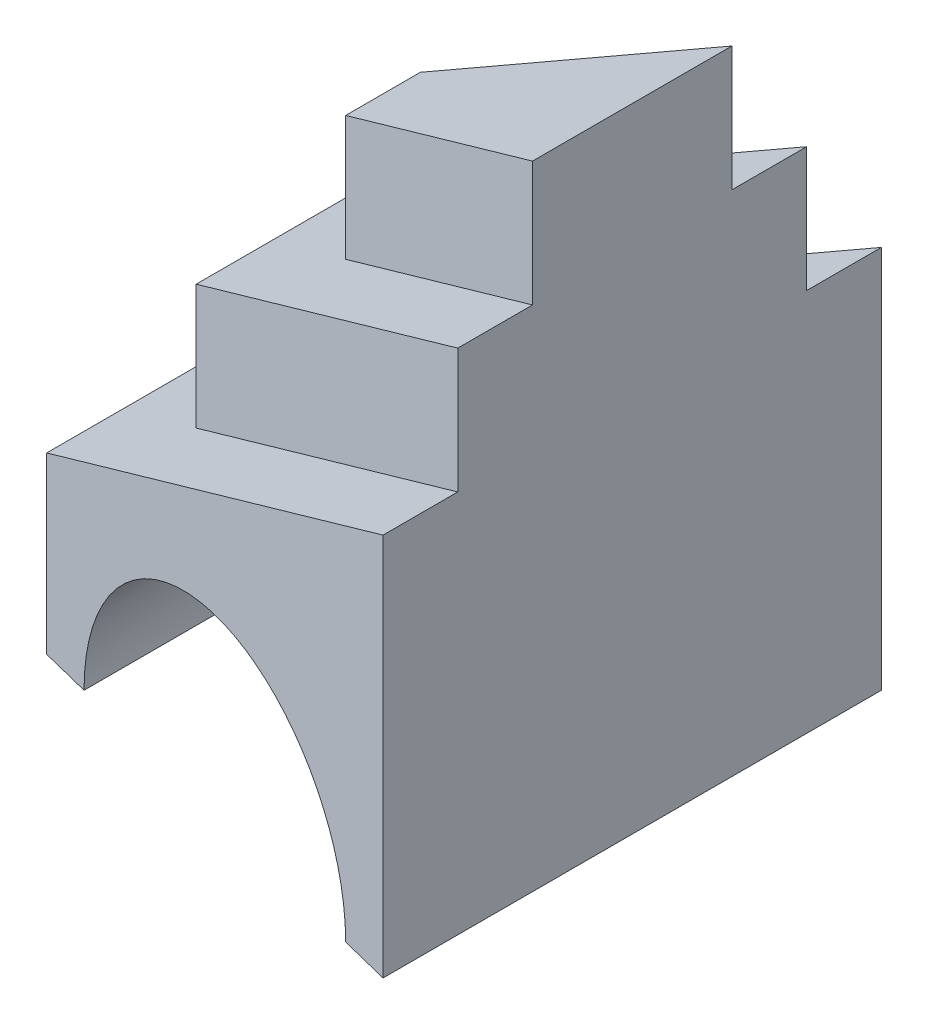
ISO-10303-21;
HEADER;
FILE_DESCRIPTION(('STEP AP214'),'2;1');
FILE_NAME('part.step','',(''),(''),'','','');
FILE_SCHEMA(('AUTOMOTIVE_DESIGN { 1 0 10303 214 1 1 1 1 }'));
ENDSEC;
DATA;
#1=APPLICATION_CONTEXT('core data for automotive mechanical design processes');
#2=APPLICATION_PROTOCOL_DEFINITION('international standard','automotive_design',2000,#1);
#3=PRODUCT_CONTEXT('',#1,'mechanical');
#4=PRODUCT('Part','Part','',(#3));
#5=PRODUCT_RELATED_PRODUCT_CATEGORY('part','',(#4));
#6=PRODUCT_DEFINITION_FORMATION('','',#4);
#7=PRODUCT_DEFINITION_CONTEXT('part definition',#1,'design');
#8=PRODUCT_DEFINITION('design','',#6,#7);
#9=PRODUCT_DEFINITION_SHAPE('','',#8);
#10=(LENGTH_UNIT() NAMED_UNIT(*) SI_UNIT(.MILLI.,.METRE.));
#11=(NAMED_UNIT(*) PLANE_ANGLE_UNIT() SI_UNIT($,.RADIAN.));
#12=(NAMED_UNIT(*) SI_UNIT($,.STERADIAN.) SOLID_ANGLE_UNIT());
#13=UNCERTAINTY_MEASURE_WITH_UNIT(LENGTH_MEASURE(1.E-05),#10,'distance_accuracy_value','');
#14=(GEOMETRIC_REPRESENTATION_CONTEXT(3) GLOBAL_UNCERTAINTY_ASSIGNED_CONTEXT((#13)) GLOBAL_UNIT_ASSIGNED_CONTEXT((#10,
#11,#12)) REPRESENTATION_CONTEXT('',''));
#15=CARTESIAN_POINT('',(0.,0.,0.));
#16=DIRECTION('',(0.,0.,1.));
#17=DIRECTION('',(1.,0.,0.));
#18=AXIS2_PLACEMENT_3D('',#15,#16,#17);
#19=CARTESIAN_POINT('',(0.,0.,0.));
#20=DIRECTION('',(0.,-1.,0.));
#21=DIRECTION('',(0.,0.,-1.));
#22=AXIS2_PLACEMENT_3D('',#19,#20,#21);
#23=PLANE('',#22);
#24=DIRECTION('',(0.,0.,1.));
#25=VECTOR('',#24,1.);
#26=CARTESIAN_POINT('',(80.,0.,-88.484));
#27=LINE('',#26,#25);
#28=CARTESIAN_POINT('',(80.,0.,-75.));
#29=VERTEX_POINT('',#28);
#30=CARTESIAN_POINT('',(80.,0.,20.));
#31=VERTEX_POINT('',#30);
#32=EDGE_CURVE('E11',#29,#31,#27,.T.);
#33=ORIENTED_EDGE('',*,*,#32,.F.);
#34=DIRECTION('',(-0.970142500145332,0.,0.242535625036333));
#35=VECTOR('',#34,1.);
#36=CARTESIAN_POINT('',(0.,0.,-55.));
#37=LINE('',#36,#35);
#38=CARTESIAN_POINT('',(90.,0.,-77.5));
#39=VERTEX_POINT('',#38);
#40=EDGE_CURVE('E142',#39,#29,#37,.T.);
#41=ORIENTED_EDGE('',*,*,#40,.F.);
#42=DIRECTION('',(0.,0.,-1.));
#43=VECTOR('',#42,1.);
#44=CARTESIAN_POINT('',(90.,0.,-77.5));
#45=LINE('',#44,#43);
#46=CARTESIAN_POINT('',(90.,0.,22.5));
#47=VERTEX_POINT('',#46);
#48=EDGE_CURVE('E155',#47,#39,#45,.T.);
#49=ORIENTED_EDGE('',*,*,#48,.F.);
#50=DIRECTION('',(0.970142500145332,0.,0.242535625036333));
#51=VECTOR('',#50,1.);
#52=CARTESIAN_POINT('',(90.,0.,22.5));
#53=LINE('',#52,#51);
#54=EDGE_CURVE('E143',#31,#47,#53,.T.);
#55=ORIENTED_EDGE('',*,*,#54,.F.);
#56=EDGE_LOOP('',(#33,#41,#49,#55));
#57=FACE_BOUND('',#56,.T.);
#58=ADVANCED_FACE('F31',(#57),#23,.T.);
#59=CARTESIAN_POINT('',(90.,101.968,-76.321));
#60=DIRECTION('',(0.422618261740694,-0.906307787036653,0.));
#61=DIRECTION('',(0.906307787036653,0.422618261740694,0.));
#62=AXIS2_PLACEMENT_3D('',#59,#60,#61);
#63=PLANE('',#62);
#64=DIRECTION('',(-0.883903215348619,-0.412170838384881,0.220975803837155));
#65=VECTOR('',#64,1.);
#66=CARTESIAN_POINT('',(95.6293529832402,104.593010406543,-48.90733824581));
#67=LINE('',#66,#65);
#68=CARTESIAN_POINT('',(90.,101.968,-47.5));
#69=VERTEX_POINT('',#68);
#70=CARTESIAN_POINT('',(40.,78.6526170922505,-35.));
#71=VERTEX_POINT('',#70);
#72=EDGE_CURVE('E183',#69,#71,#67,.T.);
#73=ORIENTED_EDGE('',*,*,#72,.F.);
#74=DIRECTION('',(0.,0.,-1.));
#75=VECTOR('',#74,1.);
#76=CARTESIAN_POINT('',(90.,101.968,7.50000000000002));
#77=LINE('',#76,#75);
#78=CARTESIAN_POINT('',(90.,101.968,-62.5));
#79=VERTEX_POINT('',#78);
#80=EDGE_CURVE('E194',#69,#79,#77,.T.);
#81=ORIENTED_EDGE('',*,*,#80,.T.);
#82=DIRECTION('',(0.883903215348619,0.412170838384881,-0.220975803837155));
#83=VECTOR('',#82,1.);
#84=CARTESIAN_POINT('',(90.,101.968,-62.5));
#85=LINE('',#84,#83);
#86=CARTESIAN_POINT('',(20.,69.3264639291506,-45.));
#87=VERTEX_POINT('',#86);
#88=EDGE_CURVE('E205',#87,#79,#85,.T.);
#89=ORIENTED_EDGE('',*,*,#88,.F.);
#90=DIRECTION('',(0.,0.,1.));
#91=VECTOR('',#90,1.);
#92=CARTESIAN_POINT('',(20.,69.3264639291506,-76.321));
#93=LINE('',#92,#91);
#94=CARTESIAN_POINT('',(20.,69.3264639291506,-9.99999999999999));
#95=VERTEX_POINT('',#94);
#96=EDGE_CURVE('E245',#87,#95,#93,.T.);
#97=ORIENTED_EDGE('',*,*,#96,.T.);
#98=DIRECTION('',(-0.883903215348619,-0.412170838384881,-0.220975803837155));
#99=VECTOR('',#98,1.);
#100=CARTESIAN_POINT('',(31.8919360010427,74.8717647567259,-7.02701599973931));
#101=LINE('',#100,#99);
#102=CARTESIAN_POINT('',(90.,101.968,7.50000000000002));
#103=VERTEX_POINT('',#102);
#104=EDGE_CURVE('E208',#103,#95,#101,.T.);
#105=ORIENTED_EDGE('',*,*,#104,.F.);
#106=CARTESIAN_POINT('',(90.,101.968,-7.49999999999998));
#107=VERTEX_POINT('',#106);
#108=EDGE_CURVE('E204',#103,#107,#77,.T.);
#109=ORIENTED_EDGE('',*,*,#108,.T.);
#110=DIRECTION('',(0.883903215348619,0.412170838384881,0.220975803837155));
#111=VECTOR('',#110,1.);
#112=CARTESIAN_POINT('',(76.5577980757235,95.6997983002441,-10.8605504810691));
#113=LINE('',#112,#111);
#114=CARTESIAN_POINT('',(40.,78.6526170922505,-20.));
#115=VERTEX_POINT('',#114);
#116=EDGE_CURVE('E178',#115,#107,#113,.T.);
#117=ORIENTED_EDGE('',*,*,#116,.F.);
#118=DIRECTION('',(0.,0.,1.));
#119=VECTOR('',#118,1.);
#120=CARTESIAN_POINT('',(40.,78.6526170922505,-76.321));
#121=LINE('',#120,#119);
#122=EDGE_CURVE('E181',#71,#115,#121,.T.);
#123=ORIENTED_EDGE('',*,*,#122,.F.);
#124=EDGE_LOOP('',(#73,#81,#89,#97,#105,#109,#117,#123));
#125=FACE_BOUND('',#124,.T.);
#126=ADVANCED_FACE('F193',(#125),#63,.F.);
#127=CARTESIAN_POINT('',(90.,76.968,-90.));
#128=DIRECTION('',(0.422618261740694,-0.906307787036652,0.));
#129=DIRECTION('',(0.906307787036653,0.422618261740694,0.));
#130=AXIS2_PLACEMENT_3D('',#127,#128,#129);
#131=PLANE('',#130);
#132=DIRECTION('',(-0.883903215348619,-0.412170838384881,0.220975803837155));
#133=VECTOR('',#132,1.);
#134=CARTESIAN_POINT('',(95.3713336469624,79.4726940140842,-63.8428334117406));
#135=LINE('',#134,#133);
#136=CARTESIAN_POINT('',(90.,76.968,-62.5));
#137=VERTEX_POINT('',#136);
#138=CARTESIAN_POINT('',(20.,44.3264639291506,-45.));
#139=VERTEX_POINT('',#138);
#140=EDGE_CURVE('E175',#137,#139,#135,.T.);
#141=ORIENTED_EDGE('',*,*,#140,.F.);
#142=DIRECTION('',(0.,0.,-1.));
#143=VECTOR('',#142,1.);
#144=CARTESIAN_POINT('',(90.,76.968,-77.5));
#145=LINE('',#144,#143);
#146=CARTESIAN_POINT('',(90.,76.968,-77.5));
#147=VERTEX_POINT('',#146);
#148=EDGE_CURVE('E153',#137,#147,#145,.T.);
#149=ORIENTED_EDGE('',*,*,#148,.T.);
#150=DIRECTION('',(0.883903215348619,0.412170838384881,-0.220975803837155));
#151=VECTOR('',#150,1.);
#152=CARTESIAN_POINT('',(15.2896320013406,42.1299832586476,-58.8224080003352));
#153=LINE('',#152,#151);
#154=CARTESIAN_POINT('',(0.,35.0003107660508,-55.));
#155=VERTEX_POINT('',#154);
#156=EDGE_CURVE('E221',#155,#147,#153,.T.);
#157=ORIENTED_EDGE('',*,*,#156,.F.);
#158=DIRECTION('',(0.,0.,1.));
#159=VECTOR('',#158,1.);
#160=CARTESIAN_POINT('',(0.,35.0003107660508,-90.));
#161=LINE('',#160,#159);
#162=CARTESIAN_POINT('',(0.,35.0003107660508,0.));
#163=VERTEX_POINT('',#162);
#164=EDGE_CURVE('E219',#155,#163,#161,.T.);
#165=ORIENTED_EDGE('',*,*,#164,.T.);
#166=DIRECTION('',(-0.883903215348619,-0.412170838384881,-0.220975803837155));
#167=VECTOR('',#166,1.);
#168=CARTESIAN_POINT('',(90.,76.968,22.5));
#169=LINE('',#168,#167);
#170=CARTESIAN_POINT('',(90.,76.968,22.5));
#171=VERTEX_POINT('',#170);
#172=EDGE_CURVE('E223',#171,#163,#169,.T.);
#173=ORIENTED_EDGE('',*,*,#172,.F.);
#174=CARTESIAN_POINT('',(90.,76.968,7.50000000000004));
#175=VERTEX_POINT('',#174);
#176=EDGE_CURVE('E162',#171,#175,#145,.T.);
#177=ORIENTED_EDGE('',*,*,#176,.T.);
#178=DIRECTION('',(0.883903215348619,0.412170838384881,0.220975803837155));
#179=VECTOR('',#178,1.);
#180=CARTESIAN_POINT('',(70.956180706224,68.0877212227925,2.73904517655606));
#181=LINE('',#180,#179);
#182=CARTESIAN_POINT('',(20.,44.3264639291506,-9.99999999999997));
#183=VERTEX_POINT('',#182);
#184=EDGE_CURVE('E169',#183,#175,#181,.T.);
#185=ORIENTED_EDGE('',*,*,#184,.F.);
#186=DIRECTION('',(0.,0.,1.));
#187=VECTOR('',#186,1.);
#188=CARTESIAN_POINT('',(20.,44.3264639291506,-90.));
#189=LINE('',#188,#187);
#190=EDGE_CURVE('E172',#139,#183,#189,.T.);
#191=ORIENTED_EDGE('',*,*,#190,.F.);
#192=EDGE_LOOP('',(#141,#149,#157,#165,#173,#177,#185,#191));
#193=FACE_BOUND('',#192,.T.);
#194=ADVANCED_FACE('F236',(#193),#131,.F.);
#195=CARTESIAN_POINT('',(90.,76.968,22.5));
#196=DIRECTION('',(0.242535625036333,0.,-0.970142500145332));
#197=DIRECTION('',(-0.970142500145332,0.,-0.242535625036333));
#198=AXIS2_PLACEMENT_3D('',#195,#196,#197);
#199=PLANE('',#198);
#200=CARTESIAN_POINT('',(0.,0.,0.));
#201=VERTEX_POINT('',#200);
#202=CARTESIAN_POINT('',(9.99999999999997,0.,2.49999999999999));
#203=VERTEX_POINT('',#202);
#204=EDGE_CURVE('E226',#201,#203,#53,.T.);
#205=ORIENTED_EDGE('',*,*,#204,.T.);
#206=CARTESIAN_POINT('',(45.,0.,11.25));
#207=DIRECTION('',(0.242535625036333,0.,-0.970142500145332));
#208=DIRECTION('',(0.970142500145332,0.,0.242535625036333));
#209=AXIS2_PLACEMENT_3D('',#206,#207,#208);
#210=ELLIPSE('',#209,36.0771742241545,35.);
#211=EDGE_CURVE('E45',#203,#31,#210,.T.);
#212=ORIENTED_EDGE('',*,*,#211,.T.);
#213=ORIENTED_EDGE('',*,*,#54,.T.);
#214=DIRECTION('',(0.,-1.,0.));
#215=VECTOR('',#214,1.);
#216=CARTESIAN_POINT('',(90.,76.968,22.5));
#217=LINE('',#216,#215);
#218=EDGE_CURVE('E166',#171,#47,#217,.T.);
#219=ORIENTED_EDGE('',*,*,#218,.F.);
#220=ORIENTED_EDGE('',*,*,#172,.T.);
#221=DIRECTION('',(0.,-1.,0.));
#222=VECTOR('',#221,1.);
#223=CARTESIAN_POINT('',(0.,76.968,0.));
#224=LINE('',#223,#222);
#225=EDGE_CURVE('E159',#163,#201,#224,.T.);
#226=ORIENTED_EDGE('',*,*,#225,.T.);
#227=EDGE_LOOP('',(#205,#212,#213,#219,#220,#226));
#228=FACE_BOUND('',#227,.T.);
#229=ADVANCED_FACE('F33',(#228),#199,.F.);
#230=CARTESIAN_POINT('',(90.,76.968,-77.5));
#231=DIRECTION('',(-1.,0.,0.));
#232=DIRECTION('',(0.,0.,1.));
#233=AXIS2_PLACEMENT_3D('',#230,#231,#232);
#234=PLANE('',#233);
#235=ORIENTED_EDGE('',*,*,#48,.T.);
#236=DIRECTION('',(0.,-1.,0.));
#237=VECTOR('',#236,1.);
#238=CARTESIAN_POINT('',(90.,76.968,-77.5));
#239=LINE('',#238,#237);
#240=EDGE_CURVE('E148',#147,#39,#239,.T.);
#241=ORIENTED_EDGE('',*,*,#240,.F.);
#242=ORIENTED_EDGE('',*,*,#148,.F.);
#243=DIRECTION('',(0.,-1.,0.));
#244=VECTOR('',#243,1.);
#245=CARTESIAN_POINT('',(90.,101.968,-62.5));
#246=LINE('',#245,#244);
#247=EDGE_CURVE('E203',#79,#137,#246,.T.);
#248=ORIENTED_EDGE('',*,*,#247,.F.);
#249=ORIENTED_EDGE('',*,*,#80,.F.);
#250=DIRECTION('',(0.,-1.,0.));
#251=VECTOR('',#250,1.);
#252=CARTESIAN_POINT('',(90.,126.968,-47.5));
#253=LINE('',#252,#251);
#254=CARTESIAN_POINT('',(90.,126.968,-47.5));
#255=VERTEX_POINT('',#254);
#256=EDGE_CURVE('E190',#255,#69,#253,.T.);
#257=ORIENTED_EDGE('',*,*,#256,.F.);
#258=DIRECTION('',(0.,0.,-1.));
#259=VECTOR('',#258,1.);
#260=CARTESIAN_POINT('',(90.,126.968,-47.5));
#261=LINE('',#260,#259);
#262=CARTESIAN_POINT('',(90.,126.968,-7.49999999999998));
#263=VERTEX_POINT('',#262);
#264=EDGE_CURVE('E258',#263,#255,#261,.T.);
#265=ORIENTED_EDGE('',*,*,#264,.F.);
#266=DIRECTION('',(0.,-1.,0.));
#267=VECTOR('',#266,1.);
#268=CARTESIAN_POINT('',(90.,126.968,-7.49999999999998));
#269=LINE('',#268,#267);
#270=EDGE_CURVE('E255',#263,#107,#269,.T.);
#271=ORIENTED_EDGE('',*,*,#270,.T.);
#272=ORIENTED_EDGE('',*,*,#108,.F.);
#273=DIRECTION('',(0.,-1.,0.));
#274=VECTOR('',#273,1.);
#275=CARTESIAN_POINT('',(90.,101.968,7.50000000000002));
#276=LINE('',#275,#274);
#277=EDGE_CURVE('E207',#103,#175,#276,.T.);
#278=ORIENTED_EDGE('',*,*,#277,.T.);
#279=ORIENTED_EDGE('',*,*,#176,.F.);
#280=ORIENTED_EDGE('',*,*,#218,.T.);
#281=EDGE_LOOP('',(#235,#241,#242,#248,#249,#257,#265,#271,#272,#278,#279,#280));
#282=FACE_BOUND('',#281,.T.);
#283=ADVANCED_FACE('F199',(#282),#234,.F.);
#284=CARTESIAN_POINT('',(0.,76.968,-55.));
#285=DIRECTION('',(0.242535625036333,0.,0.970142500145332));
#286=DIRECTION('',(0.970142500145332,0.,-0.242535625036333));
#287=AXIS2_PLACEMENT_3D('',#284,#285,#286);
#288=PLANE('',#287);
#289=ORIENTED_EDGE('',*,*,#40,.T.);
#290=CARTESIAN_POINT('',(45.,0.,-66.25));
#291=DIRECTION('',(0.242535625036333,0.,0.970142500145332));
#292=DIRECTION('',(-0.970142500145332,0.,0.242535625036333));
#293=AXIS2_PLACEMENT_3D('',#290,#291,#292);
#294=ELLIPSE('',#293,36.0771742241545,35.);
#295=CARTESIAN_POINT('',(9.99999999999999,0.,-57.5));
#296=VERTEX_POINT('',#295);
#297=EDGE_CURVE('E131',#29,#296,#294,.T.);
#298=ORIENTED_EDGE('',*,*,#297,.T.);
#299=CARTESIAN_POINT('',(0.,0.,-55.));
#300=VERTEX_POINT('',#299);
#301=EDGE_CURVE('E150',#296,#300,#37,.T.);
#302=ORIENTED_EDGE('',*,*,#301,.T.);
#303=DIRECTION('',(0.,-1.,0.));
#304=VECTOR('',#303,1.);
#305=CARTESIAN_POINT('',(0.,76.968,-55.));
#306=LINE('',#305,#304);
#307=EDGE_CURVE('E161',#155,#300,#306,.T.);
#308=ORIENTED_EDGE('',*,*,#307,.F.);
#309=ORIENTED_EDGE('',*,*,#156,.T.);
#310=ORIENTED_EDGE('',*,*,#240,.T.);
#311=EDGE_LOOP('',(#289,#298,#302,#308,#309,#310));
#312=FACE_BOUND('',#311,.T.);
#313=ADVANCED_FACE('F145',(#312),#288,.F.);
#314=CARTESIAN_POINT('',(0.,76.968,0.));
#315=DIRECTION('',(1.,0.,0.));
#316=DIRECTION('',(0.,0.,-1.));
#317=AXIS2_PLACEMENT_3D('',#314,#315,#316);
#318=PLANE('',#317);
#319=ORIENTED_EDGE('',*,*,#225,.F.);
#320=ORIENTED_EDGE('',*,*,#164,.F.);
#321=ORIENTED_EDGE('',*,*,#307,.T.);
#322=DIRECTION('',(0.,0.,1.));
#323=VECTOR('',#322,1.);
#324=CARTESIAN_POINT('',(0.,0.,0.));
#325=LINE('',#324,#323);
#326=EDGE_CURVE('E149',#300,#201,#325,.T.);
#327=ORIENTED_EDGE('',*,*,#326,.T.);
#328=EDGE_LOOP('',(#319,#320,#321,#327));
#329=FACE_BOUND('',#328,.T.);
#330=ADVANCED_FACE('F292',(#329),#318,.F.);
#331=DIRECTION('',(0.,0.,1.));
#332=VECTOR('',#331,1.);
#333=CARTESIAN_POINT('',(9.99999999999998,0.,-88.484));
#334=LINE('',#333,#332);
#335=EDGE_CURVE('E39',#203,#296,#334,.F.);
#336=ORIENTED_EDGE('',*,*,#335,.F.);
#337=ORIENTED_EDGE('',*,*,#204,.F.);
#338=ORIENTED_EDGE('',*,*,#326,.F.);
#339=ORIENTED_EDGE('',*,*,#301,.F.);
#340=EDGE_LOOP('',(#336,#337,#338,#339));
#341=FACE_BOUND('',#340,.T.);
#342=ADVANCED_FACE('F284',(#341),#23,.T.);
#343=CARTESIAN_POINT('',(90.,101.968,-62.5));
#344=DIRECTION('',(0.242535625036333,0.,0.970142500145332));
#345=DIRECTION('',(0.970142500145332,0.,-0.242535625036333));
#346=AXIS2_PLACEMENT_3D('',#343,#344,#345);
#347=PLANE('',#346);
#348=DIRECTION('',(0.,-1.,0.));
#349=VECTOR('',#348,1.);
#350=CARTESIAN_POINT('',(20.,101.968,-45.));
#351=LINE('',#350,#349);
#352=EDGE_CURVE('E216',#87,#139,#351,.T.);
#353=ORIENTED_EDGE('',*,*,#352,.F.);
#354=ORIENTED_EDGE('',*,*,#88,.T.);
#355=ORIENTED_EDGE('',*,*,#247,.T.);
#356=ORIENTED_EDGE('',*,*,#140,.T.);
#357=EDGE_LOOP('',(#353,#354,#355,#356));
#358=FACE_BOUND('',#357,.T.);
#359=ADVANCED_FACE('F248',(#358),#347,.F.);
#360=CARTESIAN_POINT('',(20.,101.968,-45.));
#361=DIRECTION('',(1.,0.,0.));
#362=DIRECTION('',(0.,0.,-1.));
#363=AXIS2_PLACEMENT_3D('',#360,#361,#362);
#364=PLANE('',#363);
#365=DIRECTION('',(0.,-1.,0.));
#366=VECTOR('',#365,1.);
#367=CARTESIAN_POINT('',(20.,101.968,-9.99999999999999));
#368=LINE('',#367,#366);
#369=EDGE_CURVE('E214',#95,#183,#368,.T.);
#370=ORIENTED_EDGE('',*,*,#369,.F.);
#371=ORIENTED_EDGE('',*,*,#96,.F.);
#372=ORIENTED_EDGE('',*,*,#352,.T.);
#373=ORIENTED_EDGE('',*,*,#190,.T.);
#374=EDGE_LOOP('',(#370,#371,#372,#373));
#375=FACE_BOUND('',#374,.T.);
#376=ADVANCED_FACE('F244',(#375),#364,.F.);
#377=CARTESIAN_POINT('',(20.,101.968,-9.99999999999999));
#378=DIRECTION('',(0.242535625036333,0.,-0.970142500145332));
#379=DIRECTION('',(-0.970142500145332,0.,-0.242535625036333));
#380=AXIS2_PLACEMENT_3D('',#377,#378,#379);
#381=PLANE('',#380);
#382=ORIENTED_EDGE('',*,*,#277,.F.);
#383=ORIENTED_EDGE('',*,*,#104,.T.);
#384=ORIENTED_EDGE('',*,*,#369,.T.);
#385=ORIENTED_EDGE('',*,*,#184,.T.);
#386=EDGE_LOOP('',(#382,#383,#384,#385));
#387=FACE_BOUND('',#386,.T.);
#388=ADVANCED_FACE('F239',(#387),#381,.F.);
#389=CARTESIAN_POINT('',(90.,126.968,-47.5));
#390=DIRECTION('',(0.242535625036333,0.,0.970142500145332));
#391=DIRECTION('',(0.970142500145332,0.,-0.242535625036333));
#392=AXIS2_PLACEMENT_3D('',#389,#390,#391);
#393=PLANE('',#392);
#394=DIRECTION('',(0.,-1.,0.));
#395=VECTOR('',#394,1.);
#396=CARTESIAN_POINT('',(40.,126.968,-35.));
#397=LINE('',#396,#395);
#398=CARTESIAN_POINT('',(40.,103.65261709225,-35.));
#399=VERTEX_POINT('',#398);
#400=EDGE_CURVE('E53',#399,#71,#397,.T.);
#401=ORIENTED_EDGE('',*,*,#400,.F.);
#402=DIRECTION('',(0.883903215348619,0.412170838384881,-0.220975803837155));
#403=VECTOR('',#402,1.);
#404=CARTESIAN_POINT('',(90.,126.968,-47.5));
#405=LINE('',#404,#403);
#406=EDGE_CURVE('E260',#399,#255,#405,.T.);
#407=ORIENTED_EDGE('',*,*,#406,.T.);
#408=ORIENTED_EDGE('',*,*,#256,.T.);
#409=ORIENTED_EDGE('',*,*,#72,.T.);
#410=EDGE_LOOP('',(#401,#407,#408,#409));
#411=FACE_BOUND('',#410,.T.);
#412=ADVANCED_FACE('F187',(#411),#393,.F.);
#413=CARTESIAN_POINT('',(40.,126.968,-35.));
#414=DIRECTION('',(1.,0.,0.));
#415=DIRECTION('',(0.,0.,-1.));
#416=AXIS2_PLACEMENT_3D('',#413,#414,#415);
#417=PLANE('',#416);
#418=DIRECTION('',(0.,-1.,0.));
#419=VECTOR('',#418,1.);
#420=CARTESIAN_POINT('',(40.,126.968,-20.));
#421=LINE('',#420,#419);
#422=CARTESIAN_POINT('',(40.,103.65261709225,-20.));
#423=VERTEX_POINT('',#422);
#424=EDGE_CURVE('E253',#423,#115,#421,.T.);
#425=ORIENTED_EDGE('',*,*,#424,.F.);
#426=DIRECTION('',(0.,0.,1.));
#427=VECTOR('',#426,1.);
#428=CARTESIAN_POINT('',(40.,103.65261709225,-126.968));
#429=LINE('',#428,#427);
#430=EDGE_CURVE('E265',#399,#423,#429,.T.);
#431=ORIENTED_EDGE('',*,*,#430,.F.);
#432=ORIENTED_EDGE('',*,*,#400,.T.);
#433=ORIENTED_EDGE('',*,*,#122,.T.);
#434=EDGE_LOOP('',(#425,#431,#432,#433));
#435=FACE_BOUND('',#434,.T.);
#436=ADVANCED_FACE('F273',(#435),#417,.F.);
#437=CARTESIAN_POINT('',(40.,126.968,-20.));
#438=DIRECTION('',(0.242535625036333,0.,-0.970142500145332));
#439=DIRECTION('',(-0.970142500145332,0.,-0.242535625036333));
#440=AXIS2_PLACEMENT_3D('',#437,#438,#439);
#441=PLANE('',#440);
#442=ORIENTED_EDGE('',*,*,#270,.F.);
#443=DIRECTION('',(-0.883903215348619,-0.412170838384881,-0.220975803837155));
#444=VECTOR('',#443,1.);
#445=CARTESIAN_POINT('',(48.4942400007448,107.613546254804,-17.8764399998138));
#446=LINE('',#445,#444);
#447=EDGE_CURVE('E262',#263,#423,#446,.T.);
#448=ORIENTED_EDGE('',*,*,#447,.T.);
#449=ORIENTED_EDGE('',*,*,#424,.T.);
#450=ORIENTED_EDGE('',*,*,#116,.T.);
#451=EDGE_LOOP('',(#442,#448,#449,#450));
#452=FACE_BOUND('',#451,.T.);
#453=ADVANCED_FACE('F272',(#452),#441,.F.);
#454=CARTESIAN_POINT('',(90.,126.968,-126.968));
#455=DIRECTION('',(0.422618261740694,-0.906307787036652,0.));
#456=DIRECTION('',(0.906307787036653,0.422618261740694,0.));
#457=AXIS2_PLACEMENT_3D('',#454,#455,#456);
#458=PLANE('',#457);
#459=ORIENTED_EDGE('',*,*,#430,.T.);
#460=ORIENTED_EDGE('',*,*,#447,.F.);
#461=ORIENTED_EDGE('',*,*,#264,.T.);
#462=ORIENTED_EDGE('',*,*,#406,.F.);
#463=EDGE_LOOP('',(#459,#460,#461,#462));
#464=FACE_BOUND('',#463,.T.);
#465=ADVANCED_FACE('F268',(#464),#458,.F.);
#466=CARTESIAN_POINT('',(45.,0.,-88.484));
#467=DIRECTION('',(0.,0.,1.));
#468=DIRECTION('',(1.,0.,0.));
#469=AXIS2_PLACEMENT_3D('',#466,#467,#468);
#470=CYLINDRICAL_SURFACE('',#469,35.);
#471=ORIENTED_EDGE('',*,*,#335,.T.);
#472=ORIENTED_EDGE('',*,*,#297,.F.);
#473=ORIENTED_EDGE('',*,*,#32,.T.);
#474=ORIENTED_EDGE('',*,*,#211,.F.);
#475=EDGE_LOOP('',(#471,#472,#473,#474));
#476=FACE_BOUND('',#475,.T.);
#477=ADVANCED_FACE('F133',(#476),#470,.F.);
#478=CLOSED_SHELL('',(#58,#126,#194,#229,#283,#313,#330,#342,#359,#376,#388,#412,#436,#453,#465,#477));
#479=MANIFOLD_SOLID_BREP('B2',#478);
#480=ADVANCED_BREP_SHAPE_REPRESENTATION('',(#18,#479),#14);
#481=SHAPE_DEFINITION_REPRESENTATION(#9,#480);
ENDSEC;
END-ISO-10303-21;
